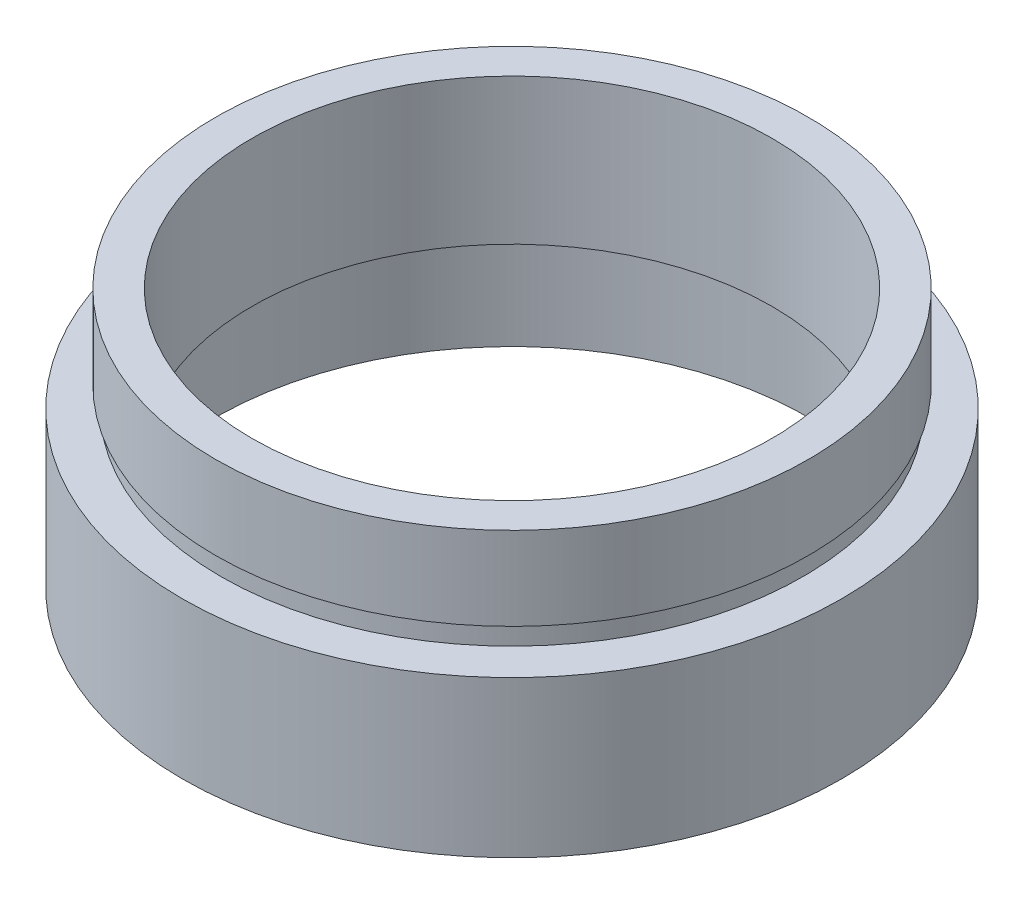
ISO-10303-21;
HEADER;
FILE_DESCRIPTION(('STEP AP214'),'2;1');
FILE_NAME('part.step','',(''),(''),'','','');
FILE_SCHEMA(('AUTOMOTIVE_DESIGN { 1 0 10303 214 1 1 1 1 }'));
ENDSEC;
DATA;
#1=APPLICATION_CONTEXT('core data for automotive mechanical design processes');
#2=APPLICATION_PROTOCOL_DEFINITION('international standard','automotive_design',2000,#1);
#3=PRODUCT_CONTEXT('',#1,'mechanical');
#4=PRODUCT('Part','Part','',(#3));
#5=PRODUCT_RELATED_PRODUCT_CATEGORY('part','',(#4));
#6=PRODUCT_DEFINITION_FORMATION('','',#4);
#7=PRODUCT_DEFINITION_CONTEXT('part definition',#1,'design');
#8=PRODUCT_DEFINITION('design','',#6,#7);
#9=PRODUCT_DEFINITION_SHAPE('','',#8);
#10=(LENGTH_UNIT() NAMED_UNIT(*) SI_UNIT(.MILLI.,.METRE.));
#11=(NAMED_UNIT(*) PLANE_ANGLE_UNIT() SI_UNIT($,.RADIAN.));
#12=(NAMED_UNIT(*) SI_UNIT($,.STERADIAN.) SOLID_ANGLE_UNIT());
#13=UNCERTAINTY_MEASURE_WITH_UNIT(LENGTH_MEASURE(1.E-05),#10,'distance_accuracy_value','');
#14=(GEOMETRIC_REPRESENTATION_CONTEXT(3) GLOBAL_UNCERTAINTY_ASSIGNED_CONTEXT((#13)) GLOBAL_UNIT_ASSIGNED_CONTEXT((#10,
#11,#12)) REPRESENTATION_CONTEXT('',''));
#15=CARTESIAN_POINT('',(0.,0.,0.));
#16=DIRECTION('',(0.,0.,1.));
#17=DIRECTION('',(1.,0.,0.));
#18=AXIS2_PLACEMENT_3D('',#15,#16,#17);
#19=CARTESIAN_POINT('',(14.25,0.,0.));
#20=DIRECTION('',(0.,1.,0.));
#21=DIRECTION('',(0.,0.,1.));
#22=AXIS2_PLACEMENT_3D('',#19,#20,#21);
#23=PLANE('',#22);
#24=CARTESIAN_POINT('',(0.,0.,0.));
#25=DIRECTION('',(0.,1.,0.));
#26=DIRECTION('',(0.,0.,1.));
#27=AXIS2_PLACEMENT_3D('',#24,#25,#26);
#28=CIRCLE('',#27,15.85);
#29=CARTESIAN_POINT('',(0.,0.,15.85));
#30=VERTEX_POINT('',#29);
#31=EDGE_CURVE('E10',#30,#30,#28,.T.);
#32=ORIENTED_EDGE('',*,*,#31,.F.);
#33=EDGE_LOOP('',(#32));
#34=FACE_BOUND('',#33,.T.);
#35=CARTESIAN_POINT('',(0.,0.,0.));
#36=DIRECTION('',(0.,1.,0.));
#37=DIRECTION('',(0.,0.,1.));
#38=AXIS2_PLACEMENT_3D('',#35,#36,#37);
#39=CIRCLE('',#38,14.25);
#40=CARTESIAN_POINT('',(0.,0.,14.25));
#41=VERTEX_POINT('',#40);
#42=EDGE_CURVE('E77',#41,#41,#39,.T.);
#43=ORIENTED_EDGE('',*,*,#42,.T.);
#44=EDGE_LOOP('',(#43));
#45=FACE_BOUND('',#44,.T.);
#46=ADVANCED_FACE('F37',(#34,#45),#23,.F.);
#47=CARTESIAN_POINT('',(0.,161.376166943427,0.));
#48=DIRECTION('',(0.,1.,0.));
#49=DIRECTION('',(0.,0.,1.));
#50=AXIS2_PLACEMENT_3D('',#47,#48,#49);
#51=CYLINDRICAL_SURFACE('',#50,15.85);
#52=CARTESIAN_POINT('',(0.,7.49999999999998,0.));
#53=DIRECTION('',(0.,1.,0.));
#54=DIRECTION('',(0.,0.,1.));
#55=AXIS2_PLACEMENT_3D('',#52,#53,#54);
#56=CIRCLE('',#55,15.85);
#57=CARTESIAN_POINT('',(0.,7.49999999999998,15.85));
#58=VERTEX_POINT('',#57);
#59=EDGE_CURVE('E43',#58,#58,#56,.T.);
#60=ORIENTED_EDGE('',*,*,#59,.F.);
#61=EDGE_LOOP('',(#60));
#62=FACE_BOUND('',#61,.T.);
#63=ORIENTED_EDGE('',*,*,#31,.T.);
#64=EDGE_LOOP('',(#63));
#65=FACE_BOUND('',#64,.T.);
#66=ADVANCED_FACE('F138',(#62,#65),#51,.T.);
#67=CARTESIAN_POINT('',(14.,7.49999999999998,0.));
#68=DIRECTION('',(0.,-1.,0.));
#69=DIRECTION('',(0.,0.,-1.));
#70=AXIS2_PLACEMENT_3D('',#67,#68,#69);
#71=PLANE('',#70);
#72=CARTESIAN_POINT('',(0.,7.49999999999998,0.));
#73=DIRECTION('',(0.,1.,0.));
#74=DIRECTION('',(0.,0.,1.));
#75=AXIS2_PLACEMENT_3D('',#72,#73,#74);
#76=CIRCLE('',#75,14.);
#77=CARTESIAN_POINT('',(0.,7.49999999999998,14.));
#78=VERTEX_POINT('',#77);
#79=EDGE_CURVE('E47',#78,#78,#76,.T.);
#80=ORIENTED_EDGE('',*,*,#79,.F.);
#81=EDGE_LOOP('',(#80));
#82=FACE_BOUND('',#81,.T.);
#83=ORIENTED_EDGE('',*,*,#59,.T.);
#84=EDGE_LOOP('',(#83));
#85=FACE_BOUND('',#84,.T.);
#86=ADVANCED_FACE('F133',(#82,#85),#71,.F.);
#87=CARTESIAN_POINT('',(0.,161.376166943427,0.));
#88=DIRECTION('',(0.,1.,0.));
#89=DIRECTION('',(0.,0.,1.));
#90=AXIS2_PLACEMENT_3D('',#87,#88,#89);
#91=CYLINDRICAL_SURFACE('',#90,14.);
#92=CARTESIAN_POINT('',(0.,8.49999999999998,0.));
#93=DIRECTION('',(0.,1.,0.));
#94=DIRECTION('',(0.,0.,1.));
#95=AXIS2_PLACEMENT_3D('',#92,#93,#94);
#96=CIRCLE('',#95,14.);
#97=CARTESIAN_POINT('',(0.,8.49999999999998,14.));
#98=VERTEX_POINT('',#97);
#99=EDGE_CURVE('E51',#98,#98,#96,.T.);
#100=ORIENTED_EDGE('',*,*,#99,.F.);
#101=EDGE_LOOP('',(#100));
#102=FACE_BOUND('',#101,.T.);
#103=ORIENTED_EDGE('',*,*,#79,.T.);
#104=EDGE_LOOP('',(#103));
#105=FACE_BOUND('',#104,.T.);
#106=ADVANCED_FACE('F127',(#102,#105),#91,.T.);
#107=CARTESIAN_POINT('',(14.,8.49999999999999,0.));
#108=DIRECTION('',(0.,1.,0.));
#109=DIRECTION('',(0.,0.,1.));
#110=AXIS2_PLACEMENT_3D('',#107,#108,#109);
#111=PLANE('',#110);
#112=CARTESIAN_POINT('',(0.,8.49999999999998,0.));
#113=DIRECTION('',(0.,1.,0.));
#114=DIRECTION('',(0.,0.,1.));
#115=AXIS2_PLACEMENT_3D('',#112,#113,#114);
#116=CIRCLE('',#115,14.25);
#117=CARTESIAN_POINT('',(0.,8.49999999999998,14.25));
#118=VERTEX_POINT('',#117);
#119=EDGE_CURVE('E56',#118,#118,#116,.T.);
#120=ORIENTED_EDGE('',*,*,#119,.F.);
#121=EDGE_LOOP('',(#120));
#122=FACE_BOUND('',#121,.T.);
#123=ORIENTED_EDGE('',*,*,#99,.T.);
#124=EDGE_LOOP('',(#123));
#125=FACE_BOUND('',#124,.T.);
#126=ADVANCED_FACE('F121',(#122,#125),#111,.F.);
#127=CARTESIAN_POINT('',(0.,161.376166943427,0.));
#128=DIRECTION('',(0.,1.,0.));
#129=DIRECTION('',(0.,0.,1.));
#130=AXIS2_PLACEMENT_3D('',#127,#128,#129);
#131=CYLINDRICAL_SURFACE('',#130,14.25);
#132=CARTESIAN_POINT('',(0.,12.5,0.));
#133=DIRECTION('',(0.,1.,0.));
#134=DIRECTION('',(0.,0.,1.));
#135=AXIS2_PLACEMENT_3D('',#132,#133,#134);
#136=CIRCLE('',#135,14.25);
#137=CARTESIAN_POINT('',(0.,12.5,14.25));
#138=VERTEX_POINT('',#137);
#139=EDGE_CURVE('E59',#138,#138,#136,.T.);
#140=ORIENTED_EDGE('',*,*,#139,.F.);
#141=EDGE_LOOP('',(#140));
#142=FACE_BOUND('',#141,.T.);
#143=ORIENTED_EDGE('',*,*,#119,.T.);
#144=EDGE_LOOP('',(#143));
#145=FACE_BOUND('',#144,.T.);
#146=ADVANCED_FACE('F115',(#142,#145),#131,.T.);
#147=CARTESIAN_POINT('',(12.5,12.5,0.));
#148=DIRECTION('',(0.,-1.,0.));
#149=DIRECTION('',(0.,0.,-1.));
#150=AXIS2_PLACEMENT_3D('',#147,#148,#149);
#151=PLANE('',#150);
#152=CARTESIAN_POINT('',(0.,12.5,0.));
#153=DIRECTION('',(0.,1.,0.));
#154=DIRECTION('',(0.,0.,1.));
#155=AXIS2_PLACEMENT_3D('',#152,#153,#154);
#156=CIRCLE('',#155,12.5);
#157=CARTESIAN_POINT('',(0.,12.5,12.5));
#158=VERTEX_POINT('',#157);
#159=EDGE_CURVE('E62',#158,#158,#156,.T.);
#160=ORIENTED_EDGE('',*,*,#159,.F.);
#161=EDGE_LOOP('',(#160));
#162=FACE_BOUND('',#161,.T.);
#163=ORIENTED_EDGE('',*,*,#139,.T.);
#164=EDGE_LOOP('',(#163));
#165=FACE_BOUND('',#164,.T.);
#166=ADVANCED_FACE('F109',(#162,#165),#151,.F.);
#167=CARTESIAN_POINT('',(0.,161.376166943427,0.));
#168=DIRECTION('',(0.,1.,0.));
#169=DIRECTION('',(0.,0.,1.));
#170=AXIS2_PLACEMENT_3D('',#167,#168,#169);
#171=CYLINDRICAL_SURFACE('',#170,12.5);
#172=CARTESIAN_POINT('',(0.,5.49999999999998,0.));
#173=DIRECTION('',(0.,1.,0.));
#174=DIRECTION('',(0.,0.,1.));
#175=AXIS2_PLACEMENT_3D('',#172,#173,#174);
#176=CIRCLE('',#175,12.5);
#177=CARTESIAN_POINT('',(0.,5.49999999999998,12.5));
#178=VERTEX_POINT('',#177);
#179=EDGE_CURVE('E65',#178,#178,#176,.T.);
#180=ORIENTED_EDGE('',*,*,#179,.F.);
#181=EDGE_LOOP('',(#180));
#182=FACE_BOUND('',#181,.T.);
#183=ORIENTED_EDGE('',*,*,#159,.T.);
#184=EDGE_LOOP('',(#183));
#185=FACE_BOUND('',#184,.T.);
#186=ADVANCED_FACE('F103',(#182,#185),#171,.F.);
#187=CARTESIAN_POINT('',(12.5,5.49999999999998,0.));
#188=DIRECTION('',(0.,1.,0.));
#189=DIRECTION('',(0.,0.,1.));
#190=AXIS2_PLACEMENT_3D('',#187,#188,#189);
#191=PLANE('',#190);
#192=CARTESIAN_POINT('',(0.,5.49999999999998,0.));
#193=DIRECTION('',(0.,1.,0.));
#194=DIRECTION('',(0.,0.,1.));
#195=AXIS2_PLACEMENT_3D('',#192,#193,#194);
#196=CIRCLE('',#195,14.35);
#197=CARTESIAN_POINT('',(0.,5.49999999999998,14.35));
#198=VERTEX_POINT('',#197);
#199=EDGE_CURVE('E68',#198,#198,#196,.T.);
#200=ORIENTED_EDGE('',*,*,#199,.F.);
#201=EDGE_LOOP('',(#200));
#202=FACE_BOUND('',#201,.T.);
#203=ORIENTED_EDGE('',*,*,#179,.T.);
#204=EDGE_LOOP('',(#203));
#205=FACE_BOUND('',#204,.T.);
#206=ADVANCED_FACE('F97',(#202,#205),#191,.F.);
#207=CARTESIAN_POINT('',(0.,161.376166943427,0.));
#208=DIRECTION('',(0.,1.,0.));
#209=DIRECTION('',(0.,0.,1.));
#210=AXIS2_PLACEMENT_3D('',#207,#208,#209);
#211=CYLINDRICAL_SURFACE('',#210,14.35);
#212=CARTESIAN_POINT('',(0.,4.49999999999998,0.));
#213=DIRECTION('',(0.,1.,0.));
#214=DIRECTION('',(0.,0.,1.));
#215=AXIS2_PLACEMENT_3D('',#212,#213,#214);
#216=CIRCLE('',#215,14.35);
#217=CARTESIAN_POINT('',(0.,4.49999999999998,14.35));
#218=VERTEX_POINT('',#217);
#219=EDGE_CURVE('E71',#218,#218,#216,.T.);
#220=ORIENTED_EDGE('',*,*,#219,.F.);
#221=EDGE_LOOP('',(#220));
#222=FACE_BOUND('',#221,.T.);
#223=ORIENTED_EDGE('',*,*,#199,.T.);
#224=EDGE_LOOP('',(#223));
#225=FACE_BOUND('',#224,.T.);
#226=ADVANCED_FACE('F91',(#222,#225),#211,.F.);
#227=CARTESIAN_POINT('',(14.25,4.50000000000001,0.));
#228=DIRECTION('',(0.,-1.,0.));
#229=DIRECTION('',(0.,0.,-1.));
#230=AXIS2_PLACEMENT_3D('',#227,#228,#229);
#231=PLANE('',#230);
#232=CARTESIAN_POINT('',(0.,4.50000000000003,0.));
#233=DIRECTION('',(0.,1.,0.));
#234=DIRECTION('',(0.,0.,1.));
#235=AXIS2_PLACEMENT_3D('',#232,#233,#234);
#236=CIRCLE('',#235,14.25);
#237=CARTESIAN_POINT('',(0.,4.50000000000003,14.25));
#238=VERTEX_POINT('',#237);
#239=EDGE_CURVE('E74',#238,#238,#236,.T.);
#240=ORIENTED_EDGE('',*,*,#239,.F.);
#241=EDGE_LOOP('',(#240));
#242=FACE_BOUND('',#241,.T.);
#243=ORIENTED_EDGE('',*,*,#219,.T.);
#244=EDGE_LOOP('',(#243));
#245=FACE_BOUND('',#244,.T.);
#246=ADVANCED_FACE('F85',(#242,#245),#231,.F.);
#247=CARTESIAN_POINT('',(0.,161.376166943427,0.));
#248=DIRECTION('',(0.,1.,0.));
#249=DIRECTION('',(0.,0.,1.));
#250=AXIS2_PLACEMENT_3D('',#247,#248,#249);
#251=CYLINDRICAL_SURFACE('',#250,14.25);
#252=ORIENTED_EDGE('',*,*,#42,.F.);
#253=EDGE_LOOP('',(#252));
#254=FACE_BOUND('',#253,.T.);
#255=ORIENTED_EDGE('',*,*,#239,.T.);
#256=EDGE_LOOP('',(#255));
#257=FACE_BOUND('',#256,.T.);
#258=ADVANCED_FACE('F82',(#254,#257),#251,.F.);
#259=CLOSED_SHELL('',(#46,#66,#86,#106,#126,#146,#166,#186,#206,#226,#246,#258));
#260=MANIFOLD_SOLID_BREP('B2',#259);
#261=ADVANCED_BREP_SHAPE_REPRESENTATION('',(#18,#260),#14);
#262=SHAPE_DEFINITION_REPRESENTATION(#9,#261);
ENDSEC;
END-ISO-10303-21;
